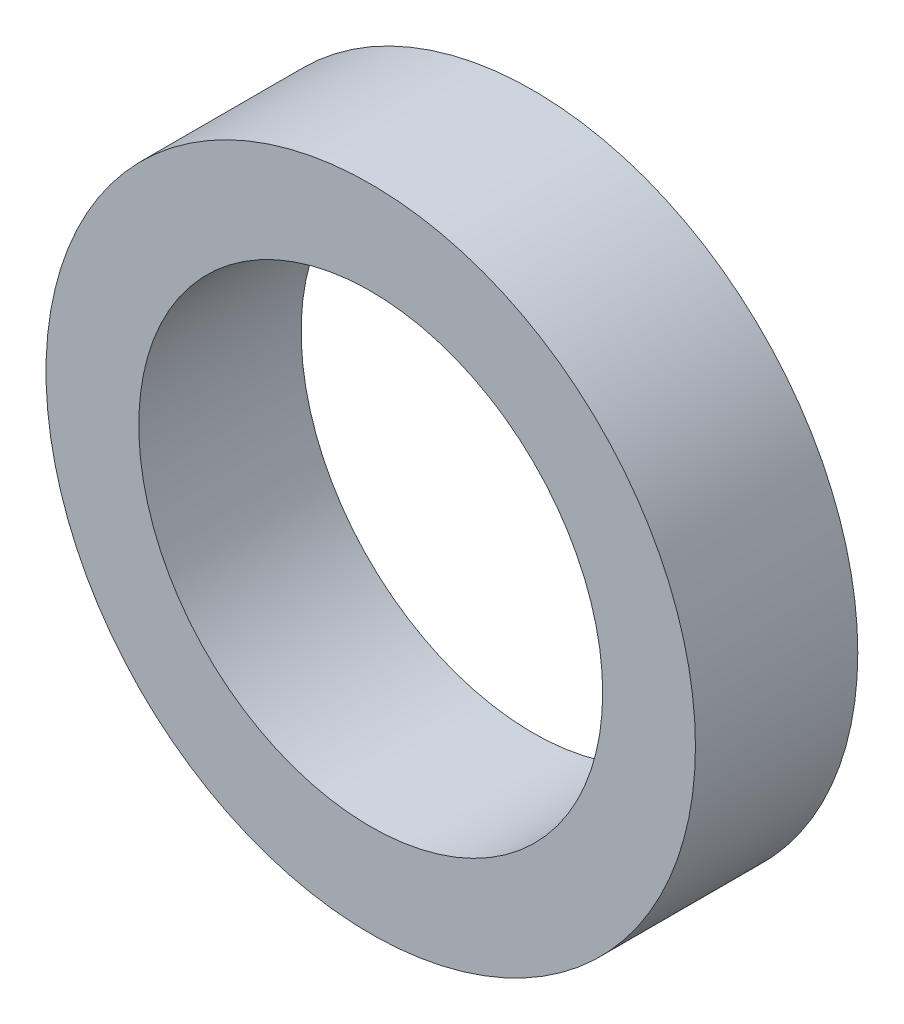
ISO-10303-21;
HEADER;
FILE_DESCRIPTION(('STEP AP214'),'2;1');
FILE_NAME('part.step','',(''),(''),'','','');
FILE_SCHEMA(('AUTOMOTIVE_DESIGN { 1 0 10303 214 1 1 1 1 }'));
ENDSEC;
DATA;
#1=APPLICATION_CONTEXT('core data for automotive mechanical design processes');
#2=APPLICATION_PROTOCOL_DEFINITION('international standard','automotive_design',2000,#1);
#3=PRODUCT_CONTEXT('',#1,'mechanical');
#4=PRODUCT('Part','Part','',(#3));
#5=PRODUCT_RELATED_PRODUCT_CATEGORY('part','',(#4));
#6=PRODUCT_DEFINITION_FORMATION('','',#4);
#7=PRODUCT_DEFINITION_CONTEXT('part definition',#1,'design');
#8=PRODUCT_DEFINITION('design','',#6,#7);
#9=PRODUCT_DEFINITION_SHAPE('','',#8);
#10=(LENGTH_UNIT() NAMED_UNIT(*) SI_UNIT(.MILLI.,.METRE.));
#11=(NAMED_UNIT(*) PLANE_ANGLE_UNIT() SI_UNIT($,.RADIAN.));
#12=(NAMED_UNIT(*) SI_UNIT($,.STERADIAN.) SOLID_ANGLE_UNIT());
#13=UNCERTAINTY_MEASURE_WITH_UNIT(LENGTH_MEASURE(1.E-05),#10,'distance_accuracy_value','');
#14=(GEOMETRIC_REPRESENTATION_CONTEXT(3) GLOBAL_UNCERTAINTY_ASSIGNED_CONTEXT((#13)) GLOBAL_UNIT_ASSIGNED_CONTEXT((#10,
#11,#12)) REPRESENTATION_CONTEXT('',''));
#15=CARTESIAN_POINT('',(0.,0.,0.));
#16=DIRECTION('',(0.,0.,1.));
#17=DIRECTION('',(1.,0.,0.));
#18=AXIS2_PLACEMENT_3D('',#15,#16,#17);
#19=CARTESIAN_POINT('',(0.,0.,10.));
#20=DIRECTION('',(0.,0.,1.));
#21=DIRECTION('',(1.,0.,0.));
#22=AXIS2_PLACEMENT_3D('',#19,#20,#21);
#23=PLANE('',#22);
#24=CARTESIAN_POINT('',(0.,0.,10.));
#25=DIRECTION('',(0.,0.,1.));
#26=DIRECTION('',(1.,0.,0.));
#27=AXIS2_PLACEMENT_3D('',#24,#25,#26);
#28=CIRCLE('',#27,20.);
#29=CARTESIAN_POINT('',(20.,0.,10.));
#30=VERTEX_POINT('',#29);
#31=EDGE_CURVE('E10',#30,#30,#28,.T.);
#32=ORIENTED_EDGE('',*,*,#31,.T.);
#33=EDGE_LOOP('',(#32));
#34=FACE_BOUND('',#33,.T.);
#35=CARTESIAN_POINT('',(0.,0.,10.));
#36=DIRECTION('',(0.,0.,1.));
#37=DIRECTION('',(1.,0.,0.));
#38=AXIS2_PLACEMENT_3D('',#35,#36,#37);
#39=CIRCLE('',#38,14.2875);
#40=CARTESIAN_POINT('',(14.2875,0.,10.));
#41=VERTEX_POINT('',#40);
#42=EDGE_CURVE('E50',#41,#41,#39,.T.);
#43=ORIENTED_EDGE('',*,*,#42,.F.);
#44=EDGE_LOOP('',(#43));
#45=FACE_BOUND('',#44,.T.);
#46=ADVANCED_FACE('F37',(#34,#45),#23,.T.);
#47=CARTESIAN_POINT('',(0.,0.,0.));
#48=DIRECTION('',(0.,0.,1.));
#49=DIRECTION('',(1.,0.,0.));
#50=AXIS2_PLACEMENT_3D('',#47,#48,#49);
#51=PLANE('',#50);
#52=CARTESIAN_POINT('',(0.,0.,0.));
#53=DIRECTION('',(0.,0.,1.));
#54=DIRECTION('',(1.,0.,0.));
#55=AXIS2_PLACEMENT_3D('',#52,#53,#54);
#56=CIRCLE('',#55,20.);
#57=CARTESIAN_POINT('',(20.,0.,0.));
#58=VERTEX_POINT('',#57);
#59=EDGE_CURVE('E41',#58,#58,#56,.T.);
#60=ORIENTED_EDGE('',*,*,#59,.F.);
#61=EDGE_LOOP('',(#60));
#62=FACE_BOUND('',#61,.T.);
#63=CARTESIAN_POINT('',(0.,0.,0.));
#64=DIRECTION('',(0.,0.,1.));
#65=DIRECTION('',(1.,0.,0.));
#66=AXIS2_PLACEMENT_3D('',#63,#64,#65);
#67=CIRCLE('',#66,14.2875);
#68=CARTESIAN_POINT('',(14.2875,0.,0.));
#69=VERTEX_POINT('',#68);
#70=EDGE_CURVE('E52',#69,#69,#67,.T.);
#71=ORIENTED_EDGE('',*,*,#70,.T.);
#72=EDGE_LOOP('',(#71));
#73=FACE_BOUND('',#72,.T.);
#74=ADVANCED_FACE('F64',(#62,#73),#51,.F.);
#75=CARTESIAN_POINT('',(0.,0.,10.));
#76=DIRECTION('',(0.,0.,-1.));
#77=DIRECTION('',(-1.,0.,0.));
#78=AXIS2_PLACEMENT_3D('',#75,#76,#77);
#79=CYLINDRICAL_SURFACE('',#78,20.);
#80=ORIENTED_EDGE('',*,*,#31,.F.);
#81=EDGE_LOOP('',(#80));
#82=FACE_BOUND('',#81,.T.);
#83=ORIENTED_EDGE('',*,*,#59,.T.);
#84=EDGE_LOOP('',(#83));
#85=FACE_BOUND('',#84,.T.);
#86=ADVANCED_FACE('F39',(#82,#85),#79,.T.);
#87=CARTESIAN_POINT('',(0.,0.,10.));
#88=DIRECTION('',(0.,0.,-1.));
#89=DIRECTION('',(-1.,0.,0.));
#90=AXIS2_PLACEMENT_3D('',#87,#88,#89);
#91=CYLINDRICAL_SURFACE('',#90,14.2875);
#92=ORIENTED_EDGE('',*,*,#42,.T.);
#93=EDGE_LOOP('',(#92));
#94=FACE_BOUND('',#93,.T.);
#95=ORIENTED_EDGE('',*,*,#70,.F.);
#96=EDGE_LOOP('',(#95));
#97=FACE_BOUND('',#96,.T.);
#98=ADVANCED_FACE('F60',(#94,#97),#91,.F.);
#99=CLOSED_SHELL('',(#46,#74,#86,#98));
#100=MANIFOLD_SOLID_BREP('B2',#99);
#101=ADVANCED_BREP_SHAPE_REPRESENTATION('',(#18,#100),#14);
#102=SHAPE_DEFINITION_REPRESENTATION(#9,#101);
ENDSEC;
END-ISO-10303-21;
